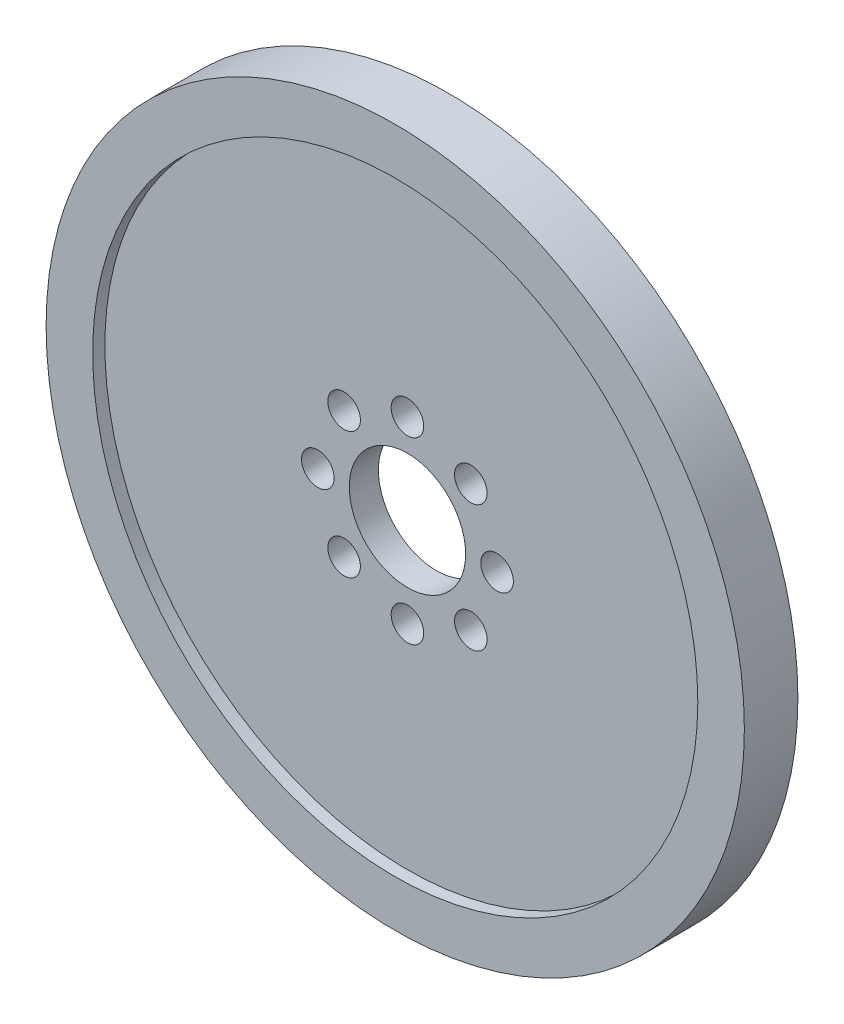
ISO-10303-21;
HEADER;
FILE_DESCRIPTION(('STEP AP214'),'2;1');
FILE_NAME('part.step','',(''),(''),'','','');
FILE_SCHEMA(('AUTOMOTIVE_DESIGN { 1 0 10303 214 1 1 1 1 }'));
ENDSEC;
DATA;
#1=APPLICATION_CONTEXT('core data for automotive mechanical design processes');
#2=APPLICATION_PROTOCOL_DEFINITION('international standard','automotive_design',2000,#1);
#3=PRODUCT_CONTEXT('',#1,'mechanical');
#4=PRODUCT('Part','Part','',(#3));
#5=PRODUCT_RELATED_PRODUCT_CATEGORY('part','',(#4));
#6=PRODUCT_DEFINITION_FORMATION('','',#4);
#7=PRODUCT_DEFINITION_CONTEXT('part definition',#1,'design');
#8=PRODUCT_DEFINITION('design','',#6,#7);
#9=PRODUCT_DEFINITION_SHAPE('','',#8);
#10=(LENGTH_UNIT() NAMED_UNIT(*) SI_UNIT(.MILLI.,.METRE.));
#11=(NAMED_UNIT(*) PLANE_ANGLE_UNIT() SI_UNIT($,.RADIAN.));
#12=(NAMED_UNIT(*) SI_UNIT($,.STERADIAN.) SOLID_ANGLE_UNIT());
#13=UNCERTAINTY_MEASURE_WITH_UNIT(LENGTH_MEASURE(1.E-05),#10,'distance_accuracy_value','');
#14=(GEOMETRIC_REPRESENTATION_CONTEXT(3) GLOBAL_UNCERTAINTY_ASSIGNED_CONTEXT((#13)) GLOBAL_UNIT_ASSIGNED_CONTEXT((#10,
#11,#12)) REPRESENTATION_CONTEXT('',''));
#15=CARTESIAN_POINT('',(0.,0.,0.));
#16=DIRECTION('',(0.,0.,1.));
#17=DIRECTION('',(1.,0.,0.));
#18=AXIS2_PLACEMENT_3D('',#15,#16,#17);
#19=CARTESIAN_POINT('',(0.,0.,2.921));
#20=DIRECTION('',(0.,0.,-1.));
#21=DIRECTION('',(-1.,0.,0.));
#22=AXIS2_PLACEMENT_3D('',#19,#20,#21);
#23=CYLINDRICAL_SURFACE('',#22,33.02);
#24=CARTESIAN_POINT('',(0.,0.,-2.921));
#25=DIRECTION('',(0.,0.,1.));
#26=DIRECTION('',(1.,0.,0.));
#27=AXIS2_PLACEMENT_3D('',#24,#25,#26);
#28=CIRCLE('',#27,33.02);
#29=CARTESIAN_POINT('',(33.02,0.,-2.921));
#30=VERTEX_POINT('',#29);
#31=EDGE_CURVE('E48',#30,#30,#28,.T.);
#32=ORIENTED_EDGE('',*,*,#31,.F.);
#33=EDGE_LOOP('',(#32));
#34=FACE_BOUND('',#33,.T.);
#35=CARTESIAN_POINT('',(0.,0.,-1.5875));
#36=DIRECTION('',(0.,0.,1.));
#37=DIRECTION('',(1.,0.,0.));
#38=AXIS2_PLACEMENT_3D('',#35,#36,#37);
#39=CIRCLE('',#38,33.02);
#40=CARTESIAN_POINT('',(33.02,0.,-1.5875));
#41=VERTEX_POINT('',#40);
#42=EDGE_CURVE('E51',#41,#41,#39,.T.);
#43=ORIENTED_EDGE('',*,*,#42,.T.);
#44=EDGE_LOOP('',(#43));
#45=FACE_BOUND('',#44,.T.);
#46=ADVANCED_FACE('F30',(#34,#45),#23,.F.);
#47=CARTESIAN_POINT('',(0.,0.,2.921));
#48=DIRECTION('',(0.,0.,1.));
#49=DIRECTION('',(1.,0.,0.));
#50=AXIS2_PLACEMENT_3D('',#47,#48,#49);
#51=PLANE('',#50);
#52=CARTESIAN_POINT('',(0.,0.,2.921));
#53=DIRECTION('',(0.,0.,1.));
#54=DIRECTION('',(1.,0.,0.));
#55=AXIS2_PLACEMENT_3D('',#52,#53,#54);
#56=CIRCLE('',#55,38.1);
#57=CARTESIAN_POINT('',(38.1,0.,2.921));
#58=VERTEX_POINT('',#57);
#59=EDGE_CURVE('E37',#58,#58,#56,.T.);
#60=ORIENTED_EDGE('',*,*,#59,.T.);
#61=EDGE_LOOP('',(#60));
#62=FACE_BOUND('',#61,.T.);
#63=CARTESIAN_POINT('',(0.,0.,2.921));
#64=DIRECTION('',(0.,0.,1.));
#65=DIRECTION('',(1.,0.,0.));
#66=AXIS2_PLACEMENT_3D('',#63,#64,#65);
#67=CIRCLE('',#66,33.02);
#68=CARTESIAN_POINT('',(33.02,0.,2.921));
#69=VERTEX_POINT('',#68);
#70=EDGE_CURVE('E46',#69,#69,#67,.T.);
#71=ORIENTED_EDGE('',*,*,#70,.F.);
#72=EDGE_LOOP('',(#71));
#73=FACE_BOUND('',#72,.T.);
#74=ADVANCED_FACE('F133',(#62,#73),#51,.T.);
#75=CARTESIAN_POINT('',(0.,0.,-2.921));
#76=DIRECTION('',(0.,0.,1.));
#77=DIRECTION('',(1.,0.,0.));
#78=AXIS2_PLACEMENT_3D('',#75,#76,#77);
#79=PLANE('',#78);
#80=CARTESIAN_POINT('',(0.,0.,-2.921));
#81=DIRECTION('',(0.,0.,1.));
#82=DIRECTION('',(1.,0.,0.));
#83=AXIS2_PLACEMENT_3D('',#80,#81,#82);
#84=CIRCLE('',#83,38.1);
#85=CARTESIAN_POINT('',(38.1,0.,-2.921));
#86=VERTEX_POINT('',#85);
#87=EDGE_CURVE('E41',#86,#86,#84,.T.);
#88=ORIENTED_EDGE('',*,*,#87,.F.);
#89=EDGE_LOOP('',(#88));
#90=FACE_BOUND('',#89,.T.);
#91=ORIENTED_EDGE('',*,*,#31,.T.);
#92=EDGE_LOOP('',(#91));
#93=FACE_BOUND('',#92,.T.);
#94=ADVANCED_FACE('F138',(#90,#93),#79,.F.);
#95=CARTESIAN_POINT('',(0.,0.,2.921));
#96=DIRECTION('',(0.,0.,-1.));
#97=DIRECTION('',(-1.,0.,0.));
#98=AXIS2_PLACEMENT_3D('',#95,#96,#97);
#99=CYLINDRICAL_SURFACE('',#98,38.1);
#100=ORIENTED_EDGE('',*,*,#59,.F.);
#101=EDGE_LOOP('',(#100));
#102=FACE_BOUND('',#101,.T.);
#103=ORIENTED_EDGE('',*,*,#87,.T.);
#104=EDGE_LOOP('',(#103));
#105=FACE_BOUND('',#104,.T.);
#106=ADVANCED_FACE('F32',(#102,#105),#99,.T.);
#107=CARTESIAN_POINT('',(0.,0.,1.5875));
#108=DIRECTION('',(0.,0.,1.));
#109=DIRECTION('',(1.,0.,0.));
#110=AXIS2_PLACEMENT_3D('',#107,#108,#109);
#111=CIRCLE('',#110,33.02);
#112=CARTESIAN_POINT('',(33.02,0.,1.5875));
#113=VERTEX_POINT('',#112);
#114=EDGE_CURVE('E10',#113,#113,#111,.T.);
#115=ORIENTED_EDGE('',*,*,#114,.F.);
#116=EDGE_LOOP('',(#115));
#117=FACE_BOUND('',#116,.T.);
#118=ORIENTED_EDGE('',*,*,#70,.T.);
#119=EDGE_LOOP('',(#118));
#120=FACE_BOUND('',#119,.T.);
#121=ADVANCED_FACE('F117',(#117,#120),#23,.F.);
#122=CARTESIAN_POINT('',(0.,0.,1.5875));
#123=DIRECTION('',(0.,0.,1.));
#124=DIRECTION('',(1.,0.,0.));
#125=AXIS2_PLACEMENT_3D('',#122,#123,#124);
#126=PLANE('',#125);
#127=CARTESIAN_POINT('',(-9.779,1.02429588037641E-13,1.5875));
#128=DIRECTION('',(0.,0.,1.));
#129=DIRECTION('',(1.,0.,0.));
#130=AXIS2_PLACEMENT_3D('',#127,#128,#129);
#131=CIRCLE('',#130,1.778);
#132=CARTESIAN_POINT('',(-8.001,1.02429588037641E-13,1.5875));
#133=VERTEX_POINT('',#132);
#134=EDGE_CURVE('E96',#133,#133,#131,.T.);
#135=ORIENTED_EDGE('',*,*,#134,.F.);
#136=EDGE_LOOP('',(#135));
#137=FACE_BOUND('',#136,.T.);
#138=CARTESIAN_POINT('',(0.,-9.779,1.5875));
#139=DIRECTION('',(0.,0.,1.));
#140=DIRECTION('',(1.,0.,0.));
#141=AXIS2_PLACEMENT_3D('',#138,#139,#140);
#142=CIRCLE('',#141,1.778);
#143=CARTESIAN_POINT('',(1.77799999999993,-9.779,1.5875));
#144=VERTEX_POINT('',#143);
#145=EDGE_CURVE('E84',#144,#144,#142,.T.);
#146=ORIENTED_EDGE('',*,*,#145,.F.);
#147=EDGE_LOOP('',(#146));
#148=FACE_BOUND('',#147,.T.);
#149=CARTESIAN_POINT('',(9.779,0.,1.5875));
#150=DIRECTION('',(0.,0.,1.));
#151=DIRECTION('',(1.,0.,0.));
#152=AXIS2_PLACEMENT_3D('',#149,#150,#151);
#153=CIRCLE('',#152,1.778);
#154=CARTESIAN_POINT('',(11.557,0.,1.5875));
#155=VERTEX_POINT('',#154);
#156=EDGE_CURVE('E72',#155,#155,#153,.T.);
#157=ORIENTED_EDGE('',*,*,#156,.F.);
#158=EDGE_LOOP('',(#157));
#159=FACE_BOUND('',#158,.T.);
#160=CARTESIAN_POINT('',(0.,9.779,1.5875));
#161=DIRECTION('',(0.,0.,1.));
#162=DIRECTION('',(1.,0.,0.));
#163=AXIS2_PLACEMENT_3D('',#160,#161,#162);
#164=CIRCLE('',#163,1.778);
#165=CARTESIAN_POINT('',(1.778,9.779,1.5875));
#166=VERTEX_POINT('',#165);
#167=EDGE_CURVE('E60',#166,#166,#164,.T.);
#168=ORIENTED_EDGE('',*,*,#167,.F.);
#169=EDGE_LOOP('',(#168));
#170=FACE_BOUND('',#169,.T.);
#171=ORIENTED_EDGE('',*,*,#114,.T.);
#172=EDGE_LOOP('',(#171));
#173=FACE_BOUND('',#172,.T.);
#174=CARTESIAN_POINT('',(0.,0.,1.5875));
#175=DIRECTION('',(0.,0.,1.));
#176=DIRECTION('',(1.,0.,0.));
#177=AXIS2_PLACEMENT_3D('',#174,#175,#176);
#178=CIRCLE('',#177,6.35);
#179=CARTESIAN_POINT('',(6.35,0.,1.5875));
#180=VERTEX_POINT('',#179);
#181=EDGE_CURVE('E56',#180,#180,#178,.T.);
#182=ORIENTED_EDGE('',*,*,#181,.F.);
#183=EDGE_LOOP('',(#182));
#184=FACE_BOUND('',#183,.T.);
#185=CARTESIAN_POINT('',(6.91479721322326,6.91479721322324,1.5875));
#186=DIRECTION('',(0.,0.,1.));
#187=DIRECTION('',(1.,0.,0.));
#188=AXIS2_PLACEMENT_3D('',#185,#186,#187);
#189=CIRCLE('',#188,1.778);
#190=CARTESIAN_POINT('',(8.69279721322326,6.91479721322324,1.5875));
#191=VERTEX_POINT('',#190);
#192=EDGE_CURVE('E66',#191,#191,#189,.T.);
#193=ORIENTED_EDGE('',*,*,#192,.F.);
#194=EDGE_LOOP('',(#193));
#195=FACE_BOUND('',#194,.T.);
#196=CARTESIAN_POINT('',(6.91479721322321,-6.91479721322328,1.5875));
#197=DIRECTION('',(0.,0.,1.));
#198=DIRECTION('',(1.,0.,0.));
#199=AXIS2_PLACEMENT_3D('',#196,#197,#198);
#200=CIRCLE('',#199,1.778);
#201=CARTESIAN_POINT('',(8.69279721322321,-6.91479721322328,1.5875));
#202=VERTEX_POINT('',#201);
#203=EDGE_CURVE('E78',#202,#202,#200,.T.);
#204=ORIENTED_EDGE('',*,*,#203,.F.);
#205=EDGE_LOOP('',(#204));
#206=FACE_BOUND('',#205,.T.);
#207=CARTESIAN_POINT('',(-6.91479721322331,-6.91479721322319,1.5875));
#208=DIRECTION('',(0.,0.,1.));
#209=DIRECTION('',(1.,0.,0.));
#210=AXIS2_PLACEMENT_3D('',#207,#208,#209);
#211=CIRCLE('',#210,1.778);
#212=CARTESIAN_POINT('',(-5.13679721322331,-6.91479721322319,1.5875));
#213=VERTEX_POINT('',#212);
#214=EDGE_CURVE('E90',#213,#213,#211,.T.);
#215=ORIENTED_EDGE('',*,*,#214,.F.);
#216=EDGE_LOOP('',(#215));
#217=FACE_BOUND('',#216,.T.);
#218=CARTESIAN_POINT('',(-6.91479721322316,6.91479721322333,1.5875));
#219=DIRECTION('',(0.,0.,1.));
#220=DIRECTION('',(1.,0.,0.));
#221=AXIS2_PLACEMENT_3D('',#218,#219,#220);
#222=CIRCLE('',#221,1.778);
#223=CARTESIAN_POINT('',(-5.13679721322316,6.91479721322333,1.5875));
#224=VERTEX_POINT('',#223);
#225=EDGE_CURVE('E102',#224,#224,#222,.T.);
#226=ORIENTED_EDGE('',*,*,#225,.F.);
#227=EDGE_LOOP('',(#226));
#228=FACE_BOUND('',#227,.T.);
#229=ADVANCED_FACE('F114',(#137,#148,#159,#170,#173,#184,#195,#206,#217,#228),#126,.T.);
#230=CARTESIAN_POINT('',(0.,0.,-1.5875));
#231=DIRECTION('',(0.,0.,1.));
#232=DIRECTION('',(1.,0.,0.));
#233=AXIS2_PLACEMENT_3D('',#230,#231,#232);
#234=PLANE('',#233);
#235=CARTESIAN_POINT('',(-9.779,1.02429588037641E-13,-1.5875));
#236=DIRECTION('',(0.,0.,1.));
#237=DIRECTION('',(1.,0.,0.));
#238=AXIS2_PLACEMENT_3D('',#235,#236,#237);
#239=CIRCLE('',#238,1.778);
#240=CARTESIAN_POINT('',(-8.001,1.02429588037641E-13,-1.5875));
#241=VERTEX_POINT('',#240);
#242=EDGE_CURVE('E99',#241,#241,#239,.T.);
#243=ORIENTED_EDGE('',*,*,#242,.T.);
#244=EDGE_LOOP('',(#243));
#245=FACE_BOUND('',#244,.T.);
#246=CARTESIAN_POINT('',(0.,-9.779,-1.5875));
#247=DIRECTION('',(0.,0.,1.));
#248=DIRECTION('',(1.,0.,0.));
#249=AXIS2_PLACEMENT_3D('',#246,#247,#248);
#250=CIRCLE('',#249,1.778);
#251=CARTESIAN_POINT('',(1.77799999999993,-9.779,-1.5875));
#252=VERTEX_POINT('',#251);
#253=EDGE_CURVE('E87',#252,#252,#250,.T.);
#254=ORIENTED_EDGE('',*,*,#253,.T.);
#255=EDGE_LOOP('',(#254));
#256=FACE_BOUND('',#255,.T.);
#257=CARTESIAN_POINT('',(9.779,0.,-1.5875));
#258=DIRECTION('',(0.,0.,1.));
#259=DIRECTION('',(1.,0.,0.));
#260=AXIS2_PLACEMENT_3D('',#257,#258,#259);
#261=CIRCLE('',#260,1.778);
#262=CARTESIAN_POINT('',(11.557,0.,-1.5875));
#263=VERTEX_POINT('',#262);
#264=EDGE_CURVE('E75',#263,#263,#261,.T.);
#265=ORIENTED_EDGE('',*,*,#264,.T.);
#266=EDGE_LOOP('',(#265));
#267=FACE_BOUND('',#266,.T.);
#268=CARTESIAN_POINT('',(0.,9.779,-1.5875));
#269=DIRECTION('',(0.,0.,1.));
#270=DIRECTION('',(1.,0.,0.));
#271=AXIS2_PLACEMENT_3D('',#268,#269,#270);
#272=CIRCLE('',#271,1.778);
#273=CARTESIAN_POINT('',(1.778,9.779,-1.5875));
#274=VERTEX_POINT('',#273);
#275=EDGE_CURVE('E63',#274,#274,#272,.T.);
#276=ORIENTED_EDGE('',*,*,#275,.T.);
#277=EDGE_LOOP('',(#276));
#278=FACE_BOUND('',#277,.T.);
#279=ORIENTED_EDGE('',*,*,#42,.F.);
#280=EDGE_LOOP('',(#279));
#281=FACE_BOUND('',#280,.T.);
#282=CARTESIAN_POINT('',(0.,0.,-1.5875));
#283=DIRECTION('',(0.,0.,1.));
#284=DIRECTION('',(1.,0.,0.));
#285=AXIS2_PLACEMENT_3D('',#282,#283,#284);
#286=CIRCLE('',#285,6.35);
#287=CARTESIAN_POINT('',(6.35,0.,-1.5875));
#288=VERTEX_POINT('',#287);
#289=EDGE_CURVE('E57',#288,#288,#286,.T.);
#290=ORIENTED_EDGE('',*,*,#289,.T.);
#291=EDGE_LOOP('',(#290));
#292=FACE_BOUND('',#291,.T.);
#293=CARTESIAN_POINT('',(6.91479721322326,6.91479721322324,-1.5875));
#294=DIRECTION('',(0.,0.,1.));
#295=DIRECTION('',(1.,0.,0.));
#296=AXIS2_PLACEMENT_3D('',#293,#294,#295);
#297=CIRCLE('',#296,1.778);
#298=CARTESIAN_POINT('',(8.69279721322326,6.91479721322324,-1.5875));
#299=VERTEX_POINT('',#298);
#300=EDGE_CURVE('E69',#299,#299,#297,.T.);
#301=ORIENTED_EDGE('',*,*,#300,.T.);
#302=EDGE_LOOP('',(#301));
#303=FACE_BOUND('',#302,.T.);
#304=CARTESIAN_POINT('',(6.91479721322321,-6.91479721322328,-1.5875));
#305=DIRECTION('',(0.,0.,1.));
#306=DIRECTION('',(1.,0.,0.));
#307=AXIS2_PLACEMENT_3D('',#304,#305,#306);
#308=CIRCLE('',#307,1.778);
#309=CARTESIAN_POINT('',(8.69279721322321,-6.91479721322328,-1.5875));
#310=VERTEX_POINT('',#309);
#311=EDGE_CURVE('E81',#310,#310,#308,.T.);
#312=ORIENTED_EDGE('',*,*,#311,.T.);
#313=EDGE_LOOP('',(#312));
#314=FACE_BOUND('',#313,.T.);
#315=CARTESIAN_POINT('',(-6.91479721322331,-6.91479721322319,-1.5875));
#316=DIRECTION('',(0.,0.,1.));
#317=DIRECTION('',(1.,0.,0.));
#318=AXIS2_PLACEMENT_3D('',#315,#316,#317);
#319=CIRCLE('',#318,1.778);
#320=CARTESIAN_POINT('',(-5.13679721322331,-6.91479721322319,-1.5875));
#321=VERTEX_POINT('',#320);
#322=EDGE_CURVE('E93',#321,#321,#319,.T.);
#323=ORIENTED_EDGE('',*,*,#322,.T.);
#324=EDGE_LOOP('',(#323));
#325=FACE_BOUND('',#324,.T.);
#326=CARTESIAN_POINT('',(-6.91479721322316,6.91479721322333,-1.5875));
#327=DIRECTION('',(0.,0.,1.));
#328=DIRECTION('',(1.,0.,0.));
#329=AXIS2_PLACEMENT_3D('',#326,#327,#328);
#330=CIRCLE('',#329,1.778);
#331=CARTESIAN_POINT('',(-5.13679721322316,6.91479721322333,-1.5875));
#332=VERTEX_POINT('',#331);
#333=EDGE_CURVE('E105',#332,#332,#330,.T.);
#334=ORIENTED_EDGE('',*,*,#333,.T.);
#335=EDGE_LOOP('',(#334));
#336=FACE_BOUND('',#335,.T.);
#337=ADVANCED_FACE('F116',(#245,#256,#267,#278,#281,#292,#303,#314,#325,#336),#234,.F.);
#338=CARTESIAN_POINT('',(0.,0.,1.5875));
#339=DIRECTION('',(0.,0.,-1.));
#340=DIRECTION('',(-1.,0.,0.));
#341=AXIS2_PLACEMENT_3D('',#338,#339,#340);
#342=CYLINDRICAL_SURFACE('',#341,6.35);
#343=ORIENTED_EDGE('',*,*,#181,.T.);
#344=EDGE_LOOP('',(#343));
#345=FACE_BOUND('',#344,.T.);
#346=ORIENTED_EDGE('',*,*,#289,.F.);
#347=EDGE_LOOP('',(#346));
#348=FACE_BOUND('',#347,.T.);
#349=ADVANCED_FACE('F124',(#345,#348),#342,.F.);
#350=CARTESIAN_POINT('',(0.,9.779,1.5875));
#351=DIRECTION('',(0.,0.,-1.));
#352=DIRECTION('',(-1.,0.,0.));
#353=AXIS2_PLACEMENT_3D('',#350,#351,#352);
#354=CYLINDRICAL_SURFACE('',#353,1.778);
#355=ORIENTED_EDGE('',*,*,#167,.T.);
#356=EDGE_LOOP('',(#355));
#357=FACE_BOUND('',#356,.T.);
#358=ORIENTED_EDGE('',*,*,#275,.F.);
#359=EDGE_LOOP('',(#358));
#360=FACE_BOUND('',#359,.T.);
#361=ADVANCED_FACE('F178',(#357,#360),#354,.F.);
#362=CARTESIAN_POINT('',(6.91479721322326,6.91479721322324,1.5875));
#363=DIRECTION('',(0.,0.,-1.));
#364=DIRECTION('',(-1.,0.,0.));
#365=AXIS2_PLACEMENT_3D('',#362,#363,#364);
#366=CYLINDRICAL_SURFACE('',#365,1.778);
#367=ORIENTED_EDGE('',*,*,#192,.T.);
#368=EDGE_LOOP('',(#367));
#369=FACE_BOUND('',#368,.T.);
#370=ORIENTED_EDGE('',*,*,#300,.F.);
#371=EDGE_LOOP('',(#370));
#372=FACE_BOUND('',#371,.T.);
#373=ADVANCED_FACE('F187',(#369,#372),#366,.F.);
#374=CARTESIAN_POINT('',(9.779,0.,1.5875));
#375=DIRECTION('',(0.,0.,-1.));
#376=DIRECTION('',(-1.,0.,0.));
#377=AXIS2_PLACEMENT_3D('',#374,#375,#376);
#378=CYLINDRICAL_SURFACE('',#377,1.778);
#379=ORIENTED_EDGE('',*,*,#156,.T.);
#380=EDGE_LOOP('',(#379));
#381=FACE_BOUND('',#380,.T.);
#382=ORIENTED_EDGE('',*,*,#264,.F.);
#383=EDGE_LOOP('',(#382));
#384=FACE_BOUND('',#383,.T.);
#385=ADVANCED_FACE('F197',(#381,#384),#378,.F.);
#386=CARTESIAN_POINT('',(6.91479721322321,-6.91479721322328,1.5875));
#387=DIRECTION('',(0.,0.,-1.));
#388=DIRECTION('',(-1.,0.,0.));
#389=AXIS2_PLACEMENT_3D('',#386,#387,#388);
#390=CYLINDRICAL_SURFACE('',#389,1.778);
#391=ORIENTED_EDGE('',*,*,#203,.T.);
#392=EDGE_LOOP('',(#391));
#393=FACE_BOUND('',#392,.T.);
#394=ORIENTED_EDGE('',*,*,#311,.F.);
#395=EDGE_LOOP('',(#394));
#396=FACE_BOUND('',#395,.T.);
#397=ADVANCED_FACE('F207',(#393,#396),#390,.F.);
#398=CARTESIAN_POINT('',(0.,-9.779,1.5875));
#399=DIRECTION('',(0.,0.,-1.));
#400=DIRECTION('',(-1.,0.,0.));
#401=AXIS2_PLACEMENT_3D('',#398,#399,#400);
#402=CYLINDRICAL_SURFACE('',#401,1.778);
#403=ORIENTED_EDGE('',*,*,#145,.T.);
#404=EDGE_LOOP('',(#403));
#405=FACE_BOUND('',#404,.T.);
#406=ORIENTED_EDGE('',*,*,#253,.F.);
#407=EDGE_LOOP('',(#406));
#408=FACE_BOUND('',#407,.T.);
#409=ADVANCED_FACE('F217',(#405,#408),#402,.F.);
#410=CARTESIAN_POINT('',(-6.91479721322331,-6.91479721322319,1.5875));
#411=DIRECTION('',(0.,0.,-1.));
#412=DIRECTION('',(-1.,0.,0.));
#413=AXIS2_PLACEMENT_3D('',#410,#411,#412);
#414=CYLINDRICAL_SURFACE('',#413,1.778);
#415=ORIENTED_EDGE('',*,*,#214,.T.);
#416=EDGE_LOOP('',(#415));
#417=FACE_BOUND('',#416,.T.);
#418=ORIENTED_EDGE('',*,*,#322,.F.);
#419=EDGE_LOOP('',(#418));
#420=FACE_BOUND('',#419,.T.);
#421=ADVANCED_FACE('F227',(#417,#420),#414,.F.);
#422=CARTESIAN_POINT('',(-9.779,1.02429588037641E-13,1.5875));
#423=DIRECTION('',(0.,0.,-1.));
#424=DIRECTION('',(-1.,0.,0.));
#425=AXIS2_PLACEMENT_3D('',#422,#423,#424);
#426=CYLINDRICAL_SURFACE('',#425,1.778);
#427=ORIENTED_EDGE('',*,*,#134,.T.);
#428=EDGE_LOOP('',(#427));
#429=FACE_BOUND('',#428,.T.);
#430=ORIENTED_EDGE('',*,*,#242,.F.);
#431=EDGE_LOOP('',(#430));
#432=FACE_BOUND('',#431,.T.);
#433=ADVANCED_FACE('F237',(#429,#432),#426,.F.);
#434=CARTESIAN_POINT('',(-6.91479721322316,6.91479721322333,1.5875));
#435=DIRECTION('',(0.,0.,-1.));
#436=DIRECTION('',(-1.,0.,0.));
#437=AXIS2_PLACEMENT_3D('',#434,#435,#436);
#438=CYLINDRICAL_SURFACE('',#437,1.778);
#439=ORIENTED_EDGE('',*,*,#225,.T.);
#440=EDGE_LOOP('',(#439));
#441=FACE_BOUND('',#440,.T.);
#442=ORIENTED_EDGE('',*,*,#333,.F.);
#443=EDGE_LOOP('',(#442));
#444=FACE_BOUND('',#443,.T.);
#445=ADVANCED_FACE('F111',(#441,#444),#438,.F.);
#446=CLOSED_SHELL('',(#46,#74,#94,#106,#121,#229,#337,#349,#361,#373,#385,#397,#409,#421,#433,#445));
#447=MANIFOLD_SOLID_BREP('B2',#446);
#448=ADVANCED_BREP_SHAPE_REPRESENTATION('',(#18,#447),#14);
#449=SHAPE_DEFINITION_REPRESENTATION(#9,#448);
ENDSEC;
END-ISO-10303-21;
